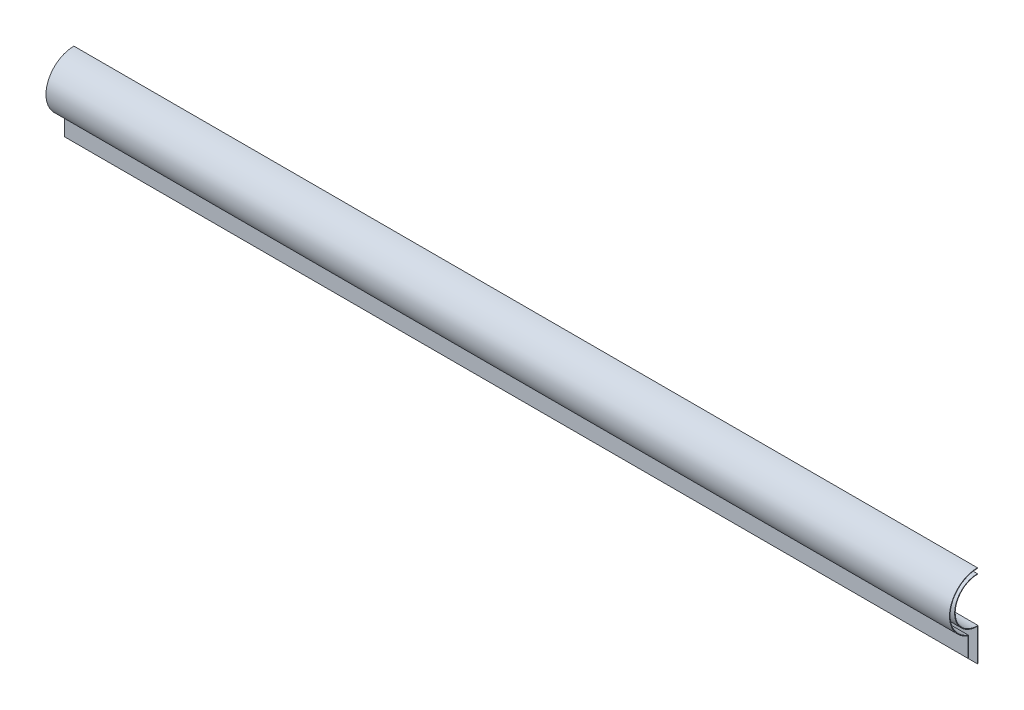
ISO-10303-21;
HEADER;
FILE_DESCRIPTION(('STEP AP214'),'2;1');
FILE_NAME('part.step','',(''),(''),'','','');
FILE_SCHEMA(('AUTOMOTIVE_DESIGN { 1 0 10303 214 1 1 1 1 }'));
ENDSEC;
DATA;
#1=APPLICATION_CONTEXT('core data for automotive mechanical design processes');
#2=APPLICATION_PROTOCOL_DEFINITION('international standard','automotive_design',2000,#1);
#3=PRODUCT_CONTEXT('',#1,'mechanical');
#4=PRODUCT('Part','Part','',(#3));
#5=PRODUCT_RELATED_PRODUCT_CATEGORY('part','',(#4));
#6=PRODUCT_DEFINITION_FORMATION('','',#4);
#7=PRODUCT_DEFINITION_CONTEXT('part definition',#1,'design');
#8=PRODUCT_DEFINITION('design','',#6,#7);
#9=PRODUCT_DEFINITION_SHAPE('','',#8);
#10=(LENGTH_UNIT() NAMED_UNIT(*) SI_UNIT(.MILLI.,.METRE.));
#11=(NAMED_UNIT(*) PLANE_ANGLE_UNIT() SI_UNIT($,.RADIAN.));
#12=(NAMED_UNIT(*) SI_UNIT($,.STERADIAN.) SOLID_ANGLE_UNIT());
#13=UNCERTAINTY_MEASURE_WITH_UNIT(LENGTH_MEASURE(1.E-05),#10,'distance_accuracy_value','');
#14=(GEOMETRIC_REPRESENTATION_CONTEXT(3) GLOBAL_UNCERTAINTY_ASSIGNED_CONTEXT((#13)) GLOBAL_UNIT_ASSIGNED_CONTEXT((#10,
#11,#12)) REPRESENTATION_CONTEXT('',''));
#15=CARTESIAN_POINT('',(0.,0.,0.));
#16=DIRECTION('',(0.,0.,1.));
#17=DIRECTION('',(1.,0.,0.));
#18=AXIS2_PLACEMENT_3D('',#15,#16,#17);
#19=CARTESIAN_POINT('',(-26.2029870226295,730.,237.681641947689));
#20=DIRECTION('',(1.,0.,0.));
#21=DIRECTION('',(0.,0.,-1.));
#22=AXIS2_PLACEMENT_3D('',#19,#20,#21);
#23=PLANE('',#22);
#24=DIRECTION('',(0.,0.,1.));
#25=VECTOR('',#24,1.);
#26=CARTESIAN_POINT('',(-26.2029870226295,699.7,237.681641947689));
#27=LINE('',#26,#25);
#28=CARTESIAN_POINT('',(-26.2029870226295,699.7,237.381641947689));
#29=VERTEX_POINT('',#28);
#30=CARTESIAN_POINT('',(-26.2029870226295,699.7,237.681641947689));
#31=VERTEX_POINT('',#30);
#32=EDGE_CURVE('E105',#29,#31,#27,.T.);
#33=ORIENTED_EDGE('',*,*,#32,.F.);
#34=DIRECTION('',(0.,1.,0.));
#35=VECTOR('',#34,1.);
#36=CARTESIAN_POINT('',(-26.2029870226295,730.,237.381641947689));
#37=LINE('',#36,#35);
#38=CARTESIAN_POINT('',(-26.2029870226295,717.80368908235,237.381641947689));
#39=VERTEX_POINT('',#38);
#40=EDGE_CURVE('E135',#29,#39,#37,.T.);
#41=ORIENTED_EDGE('',*,*,#40,.T.);
#42=CARTESIAN_POINT('',(-26.2029870226295,730.,237.681641947689));
#43=DIRECTION('',(1.,0.,0.));
#44=DIRECTION('',(0.,0.,-1.));
#45=AXIS2_PLACEMENT_3D('',#42,#43,#44);
#46=CIRCLE('',#45,12.2);
#47=CARTESIAN_POINT('',(-26.2029870226295,742.2,237.681641947689));
#48=VERTEX_POINT('',#47);
#49=EDGE_CURVE('E136',#39,#48,#46,.F.);
#50=ORIENTED_EDGE('',*,*,#49,.T.);
#51=DIRECTION('',(0.,1.,0.));
#52=VECTOR('',#51,1.);
#53=CARTESIAN_POINT('',(-26.2029870226295,746.71253636167,237.681641947689));
#54=LINE('',#53,#52);
#55=CARTESIAN_POINT('',(-26.2029870226295,742.5,237.681641947689));
#56=VERTEX_POINT('',#55);
#57=EDGE_CURVE('E68',#48,#56,#54,.T.);
#58=ORIENTED_EDGE('',*,*,#57,.T.);
#59=CARTESIAN_POINT('',(-26.2029870226295,730.,237.681641947689));
#60=DIRECTION('',(-1.,0.,0.));
#61=DIRECTION('',(0.,0.,-1.));
#62=AXIS2_PLACEMENT_3D('',#59,#60,#61);
#63=CIRCLE('',#62,12.5);
#64=CARTESIAN_POINT('',(-26.2029870226295,717.5,237.681641947689));
#65=VERTEX_POINT('',#64);
#66=EDGE_CURVE('E129',#65,#56,#63,.T.);
#67=ORIENTED_EDGE('',*,*,#66,.F.);
#68=DIRECTION('',(0.,-1.,0.));
#69=VECTOR('',#68,1.);
#70=CARTESIAN_POINT('',(-26.2029870226295,705.,237.681641947689));
#71=LINE('',#70,#69);
#72=EDGE_CURVE('E108',#65,#31,#71,.T.);
#73=ORIENTED_EDGE('',*,*,#72,.T.);
#74=EDGE_LOOP('',(#33,#41,#50,#58,#67,#73));
#75=FACE_BOUND('',#74,.T.);
#76=ADVANCED_FACE('F45',(#75),#23,.T.);
#77=CARTESIAN_POINT('',(-521.202987022629,705.,237.681641947689));
#78=DIRECTION('',(1.,0.,0.));
#79=DIRECTION('',(0.,0.,-1.));
#80=AXIS2_PLACEMENT_3D('',#77,#78,#79);
#81=PLANE('',#80);
#82=DIRECTION('',(0.,-1.,0.));
#83=VECTOR('',#82,1.);
#84=CARTESIAN_POINT('',(-521.202987022629,717.5,237.381641947689));
#85=LINE('',#84,#83);
#86=CARTESIAN_POINT('',(-521.202987022629,717.80368908235,237.381641947689));
#87=VERTEX_POINT('',#86);
#88=CARTESIAN_POINT('',(-521.202987022629,699.7,237.381641947689));
#89=VERTEX_POINT('',#88);
#90=EDGE_CURVE('E113',#87,#89,#85,.T.);
#91=ORIENTED_EDGE('',*,*,#90,.T.);
#92=DIRECTION('',(0.,0.,1.));
#93=VECTOR('',#92,1.);
#94=CARTESIAN_POINT('',(-521.202987022629,699.7,237.681641947689));
#95=LINE('',#94,#93);
#96=CARTESIAN_POINT('',(-521.202987022629,699.7,237.681641947689));
#97=VERTEX_POINT('',#96);
#98=EDGE_CURVE('E59',#89,#97,#95,.T.);
#99=ORIENTED_EDGE('',*,*,#98,.T.);
#100=DIRECTION('',(0.,-1.,0.));
#101=VECTOR('',#100,1.);
#102=CARTESIAN_POINT('',(-521.202987022629,705.,237.681641947689));
#103=LINE('',#102,#101);
#104=CARTESIAN_POINT('',(-521.202987022629,717.5,237.681641947689));
#105=VERTEX_POINT('',#104);
#106=EDGE_CURVE('E84',#105,#97,#103,.T.);
#107=ORIENTED_EDGE('',*,*,#106,.F.);
#108=CARTESIAN_POINT('',(-521.202987022629,730.,237.681641947689));
#109=DIRECTION('',(1.,0.,0.));
#110=DIRECTION('',(0.,0.,-1.));
#111=AXIS2_PLACEMENT_3D('',#108,#109,#110);
#112=CIRCLE('',#111,12.5);
#113=CARTESIAN_POINT('',(-521.202987022629,742.5,237.681641947689));
#114=VERTEX_POINT('',#113);
#115=EDGE_CURVE('E124',#105,#114,#112,.F.);
#116=ORIENTED_EDGE('',*,*,#115,.T.);
#117=DIRECTION('',(0.,1.,0.));
#118=VECTOR('',#117,1.);
#119=CARTESIAN_POINT('',(-521.202987022629,746.71253636167,237.681641947689));
#120=LINE('',#119,#118);
#121=CARTESIAN_POINT('',(-521.202987022629,742.2,237.681641947689));
#122=VERTEX_POINT('',#121);
#123=EDGE_CURVE('E133',#122,#114,#120,.T.);
#124=ORIENTED_EDGE('',*,*,#123,.F.);
#125=CARTESIAN_POINT('',(-521.202987022629,730.,237.681641947689));
#126=DIRECTION('',(1.,0.,0.));
#127=DIRECTION('',(0.,0.,-1.));
#128=AXIS2_PLACEMENT_3D('',#125,#126,#127);
#129=CIRCLE('',#128,12.2);
#130=EDGE_CURVE('E119',#87,#122,#129,.F.);
#131=ORIENTED_EDGE('',*,*,#130,.F.);
#132=EDGE_LOOP('',(#91,#99,#107,#116,#124,#131));
#133=FACE_BOUND('',#132,.T.);
#134=ADVANCED_FACE('F111',(#133),#81,.F.);
#135=CARTESIAN_POINT('',(-568.637151925155,717.5,237.681641947689));
#136=DIRECTION('',(0.,0.,-1.));
#137=DIRECTION('',(-1.,0.,0.));
#138=AXIS2_PLACEMENT_3D('',#135,#136,#137);
#139=PLANE('',#138);
#140=ORIENTED_EDGE('',*,*,#106,.T.);
#141=DIRECTION('',(1.,0.,0.));
#142=VECTOR('',#141,1.);
#143=CARTESIAN_POINT('',(-521.202987022629,699.7,237.681641947689));
#144=LINE('',#143,#142);
#145=EDGE_CURVE('E102',#97,#31,#144,.T.);
#146=ORIENTED_EDGE('',*,*,#145,.T.);
#147=ORIENTED_EDGE('',*,*,#72,.F.);
#148=DIRECTION('',(1.,0.,0.));
#149=VECTOR('',#148,1.);
#150=CARTESIAN_POINT('',(-568.637151925155,717.5,237.681641947689));
#151=LINE('',#150,#149);
#152=EDGE_CURVE('E117',#105,#65,#151,.T.);
#153=ORIENTED_EDGE('',*,*,#152,.F.);
#154=EDGE_LOOP('',(#140,#146,#147,#153));
#155=FACE_BOUND('',#154,.T.);
#156=ADVANCED_FACE('F115',(#155),#139,.F.);
#157=CARTESIAN_POINT('',(-568.637151925155,730.,237.681641947689));
#158=DIRECTION('',(1.,0.,0.));
#159=DIRECTION('',(0.,0.,-1.));
#160=AXIS2_PLACEMENT_3D('',#157,#158,#159);
#161=CYLINDRICAL_SURFACE('',#160,12.2);
#162=DIRECTION('',(1.,0.,0.));
#163=VECTOR('',#162,1.);
#164=CARTESIAN_POINT('',(-568.637151925155,742.2,237.681641947689));
#165=LINE('',#164,#163);
#166=EDGE_CURVE('E76',#48,#122,#165,.F.);
#167=ORIENTED_EDGE('',*,*,#166,.F.);
#168=ORIENTED_EDGE('',*,*,#49,.F.);
#169=DIRECTION('',(1.,0.,0.));
#170=VECTOR('',#169,1.);
#171=CARTESIAN_POINT('',(-521.202987022629,717.80368908235,237.381641947689));
#172=LINE('',#171,#170);
#173=EDGE_CURVE('E122',#87,#39,#172,.T.);
#174=ORIENTED_EDGE('',*,*,#173,.F.);
#175=ORIENTED_EDGE('',*,*,#130,.T.);
#176=EDGE_LOOP('',(#167,#168,#174,#175));
#177=FACE_BOUND('',#176,.T.);
#178=ADVANCED_FACE('F150',(#177),#161,.F.);
#179=CARTESIAN_POINT('',(-568.637151925155,717.5,237.381641947689));
#180=DIRECTION('',(0.,0.,-1.));
#181=DIRECTION('',(-1.,0.,0.));
#182=AXIS2_PLACEMENT_3D('',#179,#180,#181);
#183=PLANE('',#182);
#184=DIRECTION('',(1.,0.,0.));
#185=VECTOR('',#184,1.);
#186=CARTESIAN_POINT('',(-568.637151925155,699.7,237.381641947689));
#187=LINE('',#186,#185);
#188=EDGE_CURVE('E12',#89,#29,#187,.T.);
#189=ORIENTED_EDGE('',*,*,#188,.F.);
#190=ORIENTED_EDGE('',*,*,#90,.F.);
#191=ORIENTED_EDGE('',*,*,#173,.T.);
#192=ORIENTED_EDGE('',*,*,#40,.F.);
#193=EDGE_LOOP('',(#189,#190,#191,#192));
#194=FACE_BOUND('',#193,.T.);
#195=ADVANCED_FACE('F147',(#194),#183,.T.);
#196=CARTESIAN_POINT('',(-568.637151925155,730.,237.681641947689));
#197=DIRECTION('',(1.,0.,0.));
#198=DIRECTION('',(0.,0.,-1.));
#199=AXIS2_PLACEMENT_3D('',#196,#197,#198);
#200=CYLINDRICAL_SURFACE('',#199,12.5);
#201=ORIENTED_EDGE('',*,*,#115,.F.);
#202=ORIENTED_EDGE('',*,*,#152,.T.);
#203=ORIENTED_EDGE('',*,*,#66,.T.);
#204=DIRECTION('',(1.,0.,0.));
#205=VECTOR('',#204,1.);
#206=CARTESIAN_POINT('',(-568.637151925155,742.5,237.681641947689));
#207=LINE('',#206,#205);
#208=EDGE_CURVE('E53',#114,#56,#207,.T.);
#209=ORIENTED_EDGE('',*,*,#208,.F.);
#210=EDGE_LOOP('',(#201,#202,#203,#209));
#211=FACE_BOUND('',#210,.T.);
#212=ADVANCED_FACE('F155',(#211),#200,.T.);
#213=CARTESIAN_POINT('',(-26.2029870226295,746.71253636167,237.681641947689));
#214=DIRECTION('',(0.,0.,1.));
#215=DIRECTION('',(1.,0.,0.));
#216=AXIS2_PLACEMENT_3D('',#213,#214,#215);
#217=PLANE('',#216);
#218=ORIENTED_EDGE('',*,*,#166,.T.);
#219=ORIENTED_EDGE('',*,*,#123,.T.);
#220=ORIENTED_EDGE('',*,*,#208,.T.);
#221=ORIENTED_EDGE('',*,*,#57,.F.);
#222=EDGE_LOOP('',(#218,#219,#220,#221));
#223=FACE_BOUND('',#222,.T.);
#224=ADVANCED_FACE('F47',(#223),#217,.F.);
#225=CARTESIAN_POINT('',(-521.202987022629,699.7,237.681641947689));
#226=DIRECTION('',(0.,1.,0.));
#227=DIRECTION('',(0.,0.,1.));
#228=AXIS2_PLACEMENT_3D('',#225,#226,#227);
#229=PLANE('',#228);
#230=ORIENTED_EDGE('',*,*,#188,.T.);
#231=ORIENTED_EDGE('',*,*,#32,.T.);
#232=ORIENTED_EDGE('',*,*,#145,.F.);
#233=ORIENTED_EDGE('',*,*,#98,.F.);
#234=EDGE_LOOP('',(#230,#231,#232,#233));
#235=FACE_BOUND('',#234,.T.);
#236=ADVANCED_FACE('F103',(#235),#229,.F.);
#237=CLOSED_SHELL('',(#76,#134,#156,#178,#195,#212,#224,#236));
#238=MANIFOLD_SOLID_BREP('B2',#237);
#239=CARTESIAN_POINT('',(-568.637151925155,730.,237.681641947689));
#240=DIRECTION('',(1.,0.,0.));
#241=DIRECTION('',(0.,0.,-1.));
#242=AXIS2_PLACEMENT_3D('',#239,#240,#241);
#243=CYLINDRICAL_SURFACE('',#242,15.);
#244=CARTESIAN_POINT('',(-521.202987022629,730.,237.681641947689));
#245=DIRECTION('',(1.,0.,0.));
#246=DIRECTION('',(0.,0.,-1.));
#247=AXIS2_PLACEMENT_3D('',#244,#245,#246);
#248=CIRCLE('',#247,15.);
#249=CARTESIAN_POINT('',(-521.202987022629,715.857864376269,242.681641947689));
#250=VERTEX_POINT('',#249);
#251=CARTESIAN_POINT('',(-521.202987022629,745.,237.681641947689));
#252=VERTEX_POINT('',#251);
#253=EDGE_CURVE('E295',#250,#252,#248,.F.);
#254=ORIENTED_EDGE('',*,*,#253,.T.);
#255=DIRECTION('',(1.,0.,0.));
#256=VECTOR('',#255,1.);
#257=CARTESIAN_POINT('',(-568.637151925155,745.,237.681641947689));
#258=LINE('',#257,#256);
#259=CARTESIAN_POINT('',(-26.2029870226295,745.,237.681641947689));
#260=VERTEX_POINT('',#259);
#261=EDGE_CURVE('E279',#252,#260,#258,.T.);
#262=ORIENTED_EDGE('',*,*,#261,.T.);
#263=CARTESIAN_POINT('',(-26.2029870226295,730.,237.681641947689));
#264=DIRECTION('',(1.,0.,0.));
#265=DIRECTION('',(0.,0.,-1.));
#266=AXIS2_PLACEMENT_3D('',#263,#264,#265);
#267=CIRCLE('',#266,15.);
#268=CARTESIAN_POINT('',(-26.2029870226295,715.857864376269,242.681641947689));
#269=VERTEX_POINT('',#268);
#270=EDGE_CURVE('E289',#260,#269,#267,.T.);
#271=ORIENTED_EDGE('',*,*,#270,.T.);
#272=DIRECTION('',(1.,0.,0.));
#273=VECTOR('',#272,1.);
#274=CARTESIAN_POINT('',(-568.637151925155,715.857864376269,242.681641947689));
#275=LINE('',#274,#273);
#276=EDGE_CURVE('E290',#250,#269,#275,.T.);
#277=ORIENTED_EDGE('',*,*,#276,.F.);
#278=EDGE_LOOP('',(#254,#262,#271,#277));
#279=FACE_BOUND('',#278,.T.);
#280=ADVANCED_FACE('F223',(#279),#243,.F.);
#281=CARTESIAN_POINT('',(-568.637151925155,705.,242.681641947689));
#282=DIRECTION('',(0.,0.,1.));
#283=DIRECTION('',(1.,0.,0.));
#284=AXIS2_PLACEMENT_3D('',#281,#282,#283);
#285=PLANE('',#284);
#286=DIRECTION('',(0.,1.,0.));
#287=VECTOR('',#286,1.);
#288=CARTESIAN_POINT('',(-521.202987022629,705.,242.681641947689));
#289=LINE('',#288,#287);
#290=CARTESIAN_POINT('',(-521.202987022629,705.,242.681641947689));
#291=VERTEX_POINT('',#290);
#292=EDGE_CURVE('E299',#291,#250,#289,.T.);
#293=ORIENTED_EDGE('',*,*,#292,.T.);
#294=ORIENTED_EDGE('',*,*,#276,.T.);
#295=DIRECTION('',(0.,-1.,0.));
#296=VECTOR('',#295,1.);
#297=CARTESIAN_POINT('',(-26.2029870226295,705.,242.681641947689));
#298=LINE('',#297,#296);
#299=CARTESIAN_POINT('',(-26.2029870226295,705.,242.681641947689));
#300=VERTEX_POINT('',#299);
#301=EDGE_CURVE('E302',#269,#300,#298,.T.);
#302=ORIENTED_EDGE('',*,*,#301,.T.);
#303=DIRECTION('',(1.,0.,0.));
#304=VECTOR('',#303,1.);
#305=CARTESIAN_POINT('',(-568.637151925155,705.,242.681641947689));
#306=LINE('',#305,#304);
#307=EDGE_CURVE('E307',#291,#300,#306,.T.);
#308=ORIENTED_EDGE('',*,*,#307,.F.);
#309=EDGE_LOOP('',(#293,#294,#302,#308));
#310=FACE_BOUND('',#309,.T.);
#311=ADVANCED_FACE('F337',(#310),#285,.F.);
#312=CARTESIAN_POINT('',(-521.202987022629,705.,237.681641947689));
#313=DIRECTION('',(1.,0.,0.));
#314=DIRECTION('',(0.,0.,-1.));
#315=AXIS2_PLACEMENT_3D('',#312,#313,#314);
#316=PLANE('',#315);
#317=ORIENTED_EDGE('',*,*,#292,.F.);
#318=DIRECTION('',(0.,0.,-1.));
#319=VECTOR('',#318,1.);
#320=CARTESIAN_POINT('',(-521.202987022629,705.,242.681641947689));
#321=LINE('',#320,#319);
#322=CARTESIAN_POINT('',(-521.202987022629,705.,242.981641947689));
#323=VERTEX_POINT('',#322);
#324=EDGE_CURVE('E327',#323,#291,#321,.T.);
#325=ORIENTED_EDGE('',*,*,#324,.F.);
#326=DIRECTION('',(0.,1.,0.));
#327=VECTOR('',#326,1.);
#328=CARTESIAN_POINT('',(-521.202987022629,705.,242.981641947689));
#329=LINE('',#328,#327);
#330=CARTESIAN_POINT('',(-521.202987022629,715.647299905593,242.981641947689));
#331=VERTEX_POINT('',#330);
#332=EDGE_CURVE('E232',#323,#331,#329,.T.);
#333=ORIENTED_EDGE('',*,*,#332,.T.);
#334=CARTESIAN_POINT('',(-521.202987022629,730.,237.681641947689));
#335=DIRECTION('',(1.,0.,0.));
#336=DIRECTION('',(0.,0.,-1.));
#337=AXIS2_PLACEMENT_3D('',#334,#335,#336);
#338=CIRCLE('',#337,15.3);
#339=CARTESIAN_POINT('',(-521.202987022629,745.3,237.681641947689));
#340=VERTEX_POINT('',#339);
#341=EDGE_CURVE('E43',#331,#340,#338,.F.);
#342=ORIENTED_EDGE('',*,*,#341,.T.);
#343=DIRECTION('',(0.,1.,0.));
#344=VECTOR('',#343,1.);
#345=CARTESIAN_POINT('',(-521.202987022629,746.71253636167,237.681641947689));
#346=LINE('',#345,#344);
#347=EDGE_CURVE('E282',#252,#340,#346,.T.);
#348=ORIENTED_EDGE('',*,*,#347,.F.);
#349=ORIENTED_EDGE('',*,*,#253,.F.);
#350=EDGE_LOOP('',(#317,#325,#333,#342,#348,#349));
#351=FACE_BOUND('',#350,.T.);
#352=ADVANCED_FACE('F294',(#351),#316,.F.);
#353=CARTESIAN_POINT('',(-26.2029870226295,730.,237.681641947689));
#354=DIRECTION('',(1.,0.,0.));
#355=DIRECTION('',(0.,0.,-1.));
#356=AXIS2_PLACEMENT_3D('',#353,#354,#355);
#357=PLANE('',#356);
#358=DIRECTION('',(0.,0.,-1.));
#359=VECTOR('',#358,1.);
#360=CARTESIAN_POINT('',(-26.2029870226295,705.,244.897619127658));
#361=LINE('',#360,#359);
#362=CARTESIAN_POINT('',(-26.2029870226295,705.,242.981641947689));
#363=VERTEX_POINT('',#362);
#364=EDGE_CURVE('E315',#363,#300,#361,.T.);
#365=ORIENTED_EDGE('',*,*,#364,.T.);
#366=ORIENTED_EDGE('',*,*,#301,.F.);
#367=ORIENTED_EDGE('',*,*,#270,.F.);
#368=DIRECTION('',(0.,1.,0.));
#369=VECTOR('',#368,1.);
#370=CARTESIAN_POINT('',(-26.2029870226295,746.71253636167,237.681641947689));
#371=LINE('',#370,#369);
#372=CARTESIAN_POINT('',(-26.2029870226295,745.3,237.681641947689));
#373=VERTEX_POINT('',#372);
#374=EDGE_CURVE('E284',#260,#373,#371,.T.);
#375=ORIENTED_EDGE('',*,*,#374,.T.);
#376=CARTESIAN_POINT('',(-26.2029870226295,730.,237.681641947689));
#377=DIRECTION('',(1.,0.,0.));
#378=DIRECTION('',(0.,0.,-1.));
#379=AXIS2_PLACEMENT_3D('',#376,#377,#378);
#380=CIRCLE('',#379,15.3);
#381=CARTESIAN_POINT('',(-26.2029870226295,715.647299905593,242.981641947689));
#382=VERTEX_POINT('',#381);
#383=EDGE_CURVE('E240',#373,#382,#380,.T.);
#384=ORIENTED_EDGE('',*,*,#383,.T.);
#385=DIRECTION('',(0.,-1.,0.));
#386=VECTOR('',#385,1.);
#387=CARTESIAN_POINT('',(-26.2029870226295,730.,242.981641947689));
#388=LINE('',#387,#386);
#389=EDGE_CURVE('E227',#382,#363,#388,.T.);
#390=ORIENTED_EDGE('',*,*,#389,.T.);
#391=EDGE_LOOP('',(#365,#366,#367,#375,#384,#390));
#392=FACE_BOUND('',#391,.T.);
#393=ADVANCED_FACE('F313',(#392),#357,.T.);
#394=CARTESIAN_POINT('',(-568.637151925155,730.,237.681641947689));
#395=DIRECTION('',(1.,0.,0.));
#396=DIRECTION('',(0.,0.,-1.));
#397=AXIS2_PLACEMENT_3D('',#394,#395,#396);
#398=CYLINDRICAL_SURFACE('',#397,15.3);
#399=DIRECTION('',(1.,0.,0.));
#400=VECTOR('',#399,1.);
#401=CARTESIAN_POINT('',(-568.637151925155,745.3,237.681641947689));
#402=LINE('',#401,#400);
#403=EDGE_CURVE('E322',#340,#373,#402,.T.);
#404=ORIENTED_EDGE('',*,*,#403,.F.);
#405=ORIENTED_EDGE('',*,*,#341,.F.);
#406=DIRECTION('',(1.,0.,0.));
#407=VECTOR('',#406,1.);
#408=CARTESIAN_POINT('',(-521.202987022629,715.647299905593,242.981641947689));
#409=LINE('',#408,#407);
#410=EDGE_CURVE('E298',#331,#382,#409,.T.);
#411=ORIENTED_EDGE('',*,*,#410,.T.);
#412=ORIENTED_EDGE('',*,*,#383,.F.);
#413=EDGE_LOOP('',(#404,#405,#411,#412));
#414=FACE_BOUND('',#413,.T.);
#415=ADVANCED_FACE('F225',(#414),#398,.T.);
#416=CARTESIAN_POINT('',(-568.637151925155,705.,242.981641947689));
#417=DIRECTION('',(0.,0.,1.));
#418=DIRECTION('',(1.,0.,0.));
#419=AXIS2_PLACEMENT_3D('',#416,#417,#418);
#420=PLANE('',#419);
#421=DIRECTION('',(-1.,0.,0.));
#422=VECTOR('',#421,1.);
#423=CARTESIAN_POINT('',(-568.637151925155,705.,242.981641947689));
#424=LINE('',#423,#422);
#425=EDGE_CURVE('E309',#363,#323,#424,.T.);
#426=ORIENTED_EDGE('',*,*,#425,.F.);
#427=ORIENTED_EDGE('',*,*,#389,.F.);
#428=ORIENTED_EDGE('',*,*,#410,.F.);
#429=ORIENTED_EDGE('',*,*,#332,.F.);
#430=EDGE_LOOP('',(#426,#427,#428,#429));
#431=FACE_BOUND('',#430,.T.);
#432=ADVANCED_FACE('F320',(#431),#420,.T.);
#433=CARTESIAN_POINT('',(-26.2029870226295,746.71253636167,237.681641947689));
#434=DIRECTION('',(0.,0.,1.));
#435=DIRECTION('',(1.,0.,0.));
#436=AXIS2_PLACEMENT_3D('',#433,#434,#435);
#437=PLANE('',#436);
#438=ORIENTED_EDGE('',*,*,#403,.T.);
#439=ORIENTED_EDGE('',*,*,#374,.F.);
#440=ORIENTED_EDGE('',*,*,#261,.F.);
#441=ORIENTED_EDGE('',*,*,#347,.T.);
#442=EDGE_LOOP('',(#438,#439,#440,#441));
#443=FACE_BOUND('',#442,.T.);
#444=ADVANCED_FACE('F281',(#443),#437,.F.);
#445=CARTESIAN_POINT('',(-26.2029870226295,705.,242.681641947689));
#446=DIRECTION('',(0.,1.,0.));
#447=DIRECTION('',(0.,0.,1.));
#448=AXIS2_PLACEMENT_3D('',#445,#446,#447);
#449=PLANE('',#448);
#450=ORIENTED_EDGE('',*,*,#425,.T.);
#451=ORIENTED_EDGE('',*,*,#324,.T.);
#452=ORIENTED_EDGE('',*,*,#307,.T.);
#453=ORIENTED_EDGE('',*,*,#364,.F.);
#454=EDGE_LOOP('',(#450,#451,#452,#453));
#455=FACE_BOUND('',#454,.T.);
#456=ADVANCED_FACE('F375',(#455),#449,.F.);
#457=CLOSED_SHELL('',(#280,#311,#352,#393,#415,#432,#444,#456));
#458=MANIFOLD_SOLID_BREP('B6',#457);
#459=ADVANCED_BREP_SHAPE_REPRESENTATION('',(#18,#238,#458),#14);
#460=SHAPE_DEFINITION_REPRESENTATION(#9,#459);
ENDSEC;
END-ISO-10303-21;
